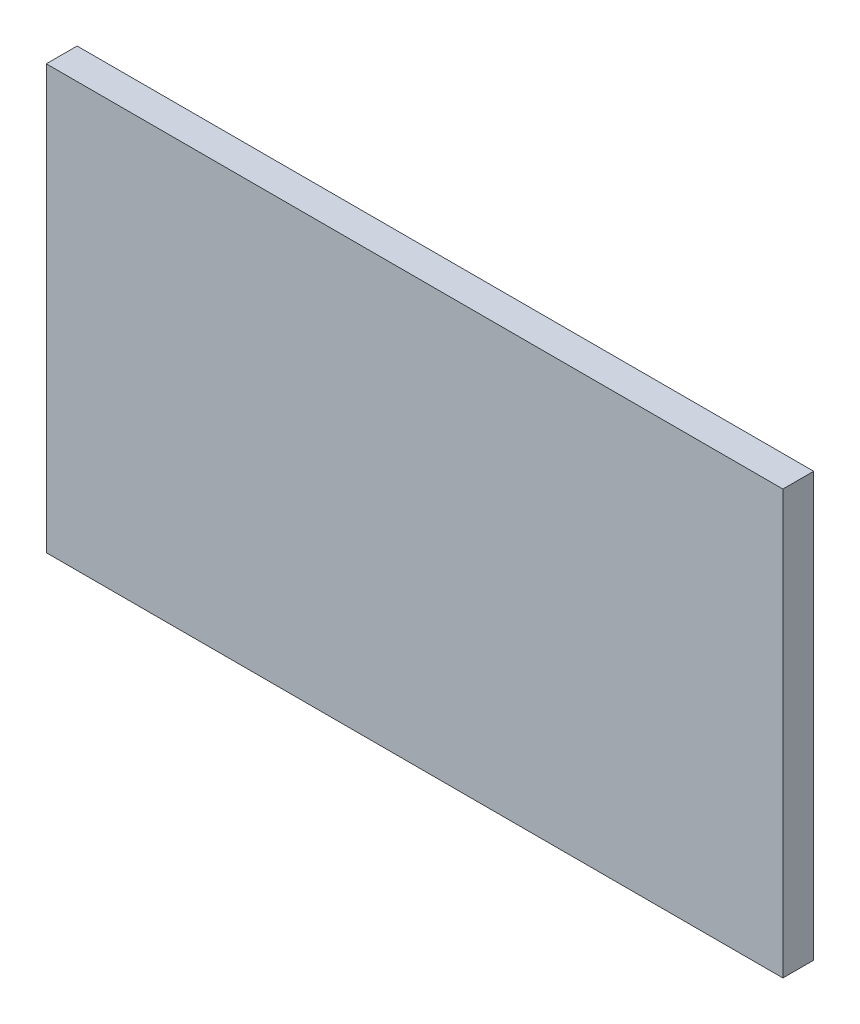
ISO-10303-21;
HEADER;
FILE_DESCRIPTION(('STEP AP214'),'2;1');
FILE_NAME('part.step','',(''),(''),'','','');
FILE_SCHEMA(('AUTOMOTIVE_DESIGN { 1 0 10303 214 1 1 1 1 }'));
ENDSEC;
DATA;
#1=APPLICATION_CONTEXT('core data for automotive mechanical design processes');
#2=APPLICATION_PROTOCOL_DEFINITION('international standard','automotive_design',2000,#1);
#3=PRODUCT_CONTEXT('',#1,'mechanical');
#4=PRODUCT('Part','Part','',(#3));
#5=PRODUCT_RELATED_PRODUCT_CATEGORY('part','',(#4));
#6=PRODUCT_DEFINITION_FORMATION('','',#4);
#7=PRODUCT_DEFINITION_CONTEXT('part definition',#1,'design');
#8=PRODUCT_DEFINITION('design','',#6,#7);
#9=PRODUCT_DEFINITION_SHAPE('','',#8);
#10=(LENGTH_UNIT() NAMED_UNIT(*) SI_UNIT(.MILLI.,.METRE.));
#11=(NAMED_UNIT(*) PLANE_ANGLE_UNIT() SI_UNIT($,.RADIAN.));
#12=(NAMED_UNIT(*) SI_UNIT($,.STERADIAN.) SOLID_ANGLE_UNIT());
#13=UNCERTAINTY_MEASURE_WITH_UNIT(LENGTH_MEASURE(1.E-05),#10,'distance_accuracy_value','');
#14=(GEOMETRIC_REPRESENTATION_CONTEXT(3) GLOBAL_UNCERTAINTY_ASSIGNED_CONTEXT((#13)) GLOBAL_UNIT_ASSIGNED_CONTEXT((#10,
#11,#12)) REPRESENTATION_CONTEXT('',''));
#15=CARTESIAN_POINT('',(0.,0.,0.));
#16=DIRECTION('',(0.,0.,1.));
#17=DIRECTION('',(1.,0.,0.));
#18=AXIS2_PLACEMENT_3D('',#15,#16,#17);
#19=CARTESIAN_POINT('',(-1004.1578807947,430.260860927152,60.96));
#20=DIRECTION('',(-1.,0.,0.));
#21=DIRECTION('',(0.,-1.,0.));
#22=AXIS2_PLACEMENT_3D('',#19,#20,#21);
#23=PLANE('',#22);
#24=DIRECTION('',(0.,1.,0.));
#25=VECTOR('',#24,1.);
#26=CARTESIAN_POINT('',(-1004.1578807947,430.260860927152,0.));
#27=LINE('',#26,#25);
#28=CARTESIAN_POINT('',(-1004.1578807947,-407.939139072848,0.));
#29=VERTEX_POINT('',#28);
#30=CARTESIAN_POINT('',(-1004.1578807947,430.260860927152,0.));
#31=VERTEX_POINT('',#30);
#32=EDGE_CURVE('E100',#29,#31,#27,.T.);
#33=ORIENTED_EDGE('',*,*,#32,.T.);
#34=DIRECTION('',(0.,0.,-1.));
#35=VECTOR('',#34,1.);
#36=CARTESIAN_POINT('',(-1004.1578807947,430.260860927152,60.96));
#37=LINE('',#36,#35);
#38=CARTESIAN_POINT('',(-1004.1578807947,430.260860927152,60.96));
#39=VERTEX_POINT('',#38);
#40=EDGE_CURVE('E11',#39,#31,#37,.T.);
#41=ORIENTED_EDGE('',*,*,#40,.F.);
#42=DIRECTION('',(0.,1.,0.));
#43=VECTOR('',#42,1.);
#44=CARTESIAN_POINT('',(-1004.1578807947,430.260860927152,60.96));
#45=LINE('',#44,#43);
#46=CARTESIAN_POINT('',(-1004.1578807947,-407.939139072848,60.96));
#47=VERTEX_POINT('',#46);
#48=EDGE_CURVE('E88',#47,#39,#45,.T.);
#49=ORIENTED_EDGE('',*,*,#48,.F.);
#50=DIRECTION('',(0.,0.,-1.));
#51=VECTOR('',#50,1.);
#52=CARTESIAN_POINT('',(-1004.1578807947,-407.939139072848,60.96));
#53=LINE('',#52,#51);
#54=EDGE_CURVE('E96',#47,#29,#53,.T.);
#55=ORIENTED_EDGE('',*,*,#54,.T.);
#56=EDGE_LOOP('',(#33,#41,#49,#55));
#57=FACE_BOUND('',#56,.T.);
#58=ADVANCED_FACE('F37',(#57),#23,.F.);
#59=CARTESIAN_POINT('',(-2462.1178807947,430.260860927152,60.96));
#60=DIRECTION('',(0.,-1.,0.));
#61=DIRECTION('',(0.,0.,-1.));
#62=AXIS2_PLACEMENT_3D('',#59,#60,#61);
#63=PLANE('',#62);
#64=DIRECTION('',(-1.,0.,0.));
#65=VECTOR('',#64,1.);
#66=CARTESIAN_POINT('',(-2462.1178807947,430.260860927152,0.));
#67=LINE('',#66,#65);
#68=CARTESIAN_POINT('',(-2462.1178807947,430.260860927152,0.));
#69=VERTEX_POINT('',#68);
#70=EDGE_CURVE('E92',#31,#69,#67,.T.);
#71=ORIENTED_EDGE('',*,*,#70,.T.);
#72=DIRECTION('',(0.,0.,-1.));
#73=VECTOR('',#72,1.);
#74=CARTESIAN_POINT('',(-2462.1178807947,430.260860927152,60.96));
#75=LINE('',#74,#73);
#76=CARTESIAN_POINT('',(-2462.1178807947,430.260860927152,60.96));
#77=VERTEX_POINT('',#76);
#78=EDGE_CURVE('E45',#77,#69,#75,.T.);
#79=ORIENTED_EDGE('',*,*,#78,.F.);
#80=DIRECTION('',(-1.,0.,0.));
#81=VECTOR('',#80,1.);
#82=CARTESIAN_POINT('',(-2462.1178807947,430.260860927152,60.96));
#83=LINE('',#82,#81);
#84=EDGE_CURVE('E83',#39,#77,#83,.T.);
#85=ORIENTED_EDGE('',*,*,#84,.F.);
#86=ORIENTED_EDGE('',*,*,#40,.T.);
#87=EDGE_LOOP('',(#71,#79,#85,#86));
#88=FACE_BOUND('',#87,.T.);
#89=ADVANCED_FACE('F91',(#88),#63,.F.);
#90=CARTESIAN_POINT('',(-2462.1178807947,430.260860927152,60.96));
#91=DIRECTION('',(1.,0.,0.));
#92=DIRECTION('',(0.,0.,-1.));
#93=AXIS2_PLACEMENT_3D('',#90,#91,#92);
#94=PLANE('',#93);
#95=DIRECTION('',(0.,-1.,0.));
#96=VECTOR('',#95,1.);
#97=CARTESIAN_POINT('',(-2462.1178807947,430.260860927152,0.));
#98=LINE('',#97,#96);
#99=CARTESIAN_POINT('',(-2462.1178807947,-407.939139072848,0.));
#100=VERTEX_POINT('',#99);
#101=EDGE_CURVE('E70',#69,#100,#98,.T.);
#102=ORIENTED_EDGE('',*,*,#101,.T.);
#103=DIRECTION('',(0.,0.,-1.));
#104=VECTOR('',#103,1.);
#105=CARTESIAN_POINT('',(-2462.1178807947,-407.939139072848,60.96));
#106=LINE('',#105,#104);
#107=CARTESIAN_POINT('',(-2462.1178807947,-407.939139072848,60.96));
#108=VERTEX_POINT('',#107);
#109=EDGE_CURVE('E93',#108,#100,#106,.T.);
#110=ORIENTED_EDGE('',*,*,#109,.F.);
#111=DIRECTION('',(0.,-1.,0.));
#112=VECTOR('',#111,1.);
#113=CARTESIAN_POINT('',(-2462.1178807947,430.260860927152,60.96));
#114=LINE('',#113,#112);
#115=EDGE_CURVE('E86',#77,#108,#114,.T.);
#116=ORIENTED_EDGE('',*,*,#115,.F.);
#117=ORIENTED_EDGE('',*,*,#78,.T.);
#118=EDGE_LOOP('',(#102,#110,#116,#117));
#119=FACE_BOUND('',#118,.T.);
#120=ADVANCED_FACE('F94',(#119),#94,.F.);
#121=CARTESIAN_POINT('',(-2462.1178807947,-407.939139072848,60.96));
#122=DIRECTION('',(0.,1.,0.));
#123=DIRECTION('',(0.,0.,1.));
#124=AXIS2_PLACEMENT_3D('',#121,#122,#123);
#125=PLANE('',#124);
#126=DIRECTION('',(1.,0.,0.));
#127=VECTOR('',#126,1.);
#128=CARTESIAN_POINT('',(-2462.1178807947,-407.939139072848,0.));
#129=LINE('',#128,#127);
#130=EDGE_CURVE('E76',#100,#29,#129,.T.);
#131=ORIENTED_EDGE('',*,*,#130,.T.);
#132=ORIENTED_EDGE('',*,*,#54,.F.);
#133=DIRECTION('',(1.,0.,0.));
#134=VECTOR('',#133,1.);
#135=CARTESIAN_POINT('',(-2462.1178807947,-407.939139072848,60.96));
#136=LINE('',#135,#134);
#137=EDGE_CURVE('E53',#108,#47,#136,.T.);
#138=ORIENTED_EDGE('',*,*,#137,.F.);
#139=ORIENTED_EDGE('',*,*,#109,.T.);
#140=EDGE_LOOP('',(#131,#132,#138,#139));
#141=FACE_BOUND('',#140,.T.);
#142=ADVANCED_FACE('F107',(#141),#125,.F.);
#143=CARTESIAN_POINT('',(0.,0.,60.96));
#144=DIRECTION('',(0.,0.,1.));
#145=DIRECTION('',(1.,0.,0.));
#146=AXIS2_PLACEMENT_3D('',#143,#144,#145);
#147=PLANE('',#146);
#148=ORIENTED_EDGE('',*,*,#48,.T.);
#149=ORIENTED_EDGE('',*,*,#84,.T.);
#150=ORIENTED_EDGE('',*,*,#115,.T.);
#151=ORIENTED_EDGE('',*,*,#137,.T.);
#152=EDGE_LOOP('',(#148,#149,#150,#151));
#153=FACE_BOUND('',#152,.T.);
#154=ADVANCED_FACE('F84',(#153),#147,.T.);
#155=CARTESIAN_POINT('',(0.,0.,0.));
#156=DIRECTION('',(0.,0.,1.));
#157=DIRECTION('',(1.,0.,0.));
#158=AXIS2_PLACEMENT_3D('',#155,#156,#157);
#159=PLANE('',#158);
#160=ORIENTED_EDGE('',*,*,#32,.F.);
#161=ORIENTED_EDGE('',*,*,#130,.F.);
#162=ORIENTED_EDGE('',*,*,#101,.F.);
#163=ORIENTED_EDGE('',*,*,#70,.F.);
#164=EDGE_LOOP('',(#160,#161,#162,#163));
#165=FACE_BOUND('',#164,.T.);
#166=ADVANCED_FACE('F110',(#165),#159,.F.);
#167=CLOSED_SHELL('',(#58,#89,#120,#142,#154,#166));
#168=MANIFOLD_SOLID_BREP('B2',#167);
#169=ADVANCED_BREP_SHAPE_REPRESENTATION('',(#18,#168),#14);
#170=SHAPE_DEFINITION_REPRESENTATION(#9,#169);
ENDSEC;
END-ISO-10303-21;
